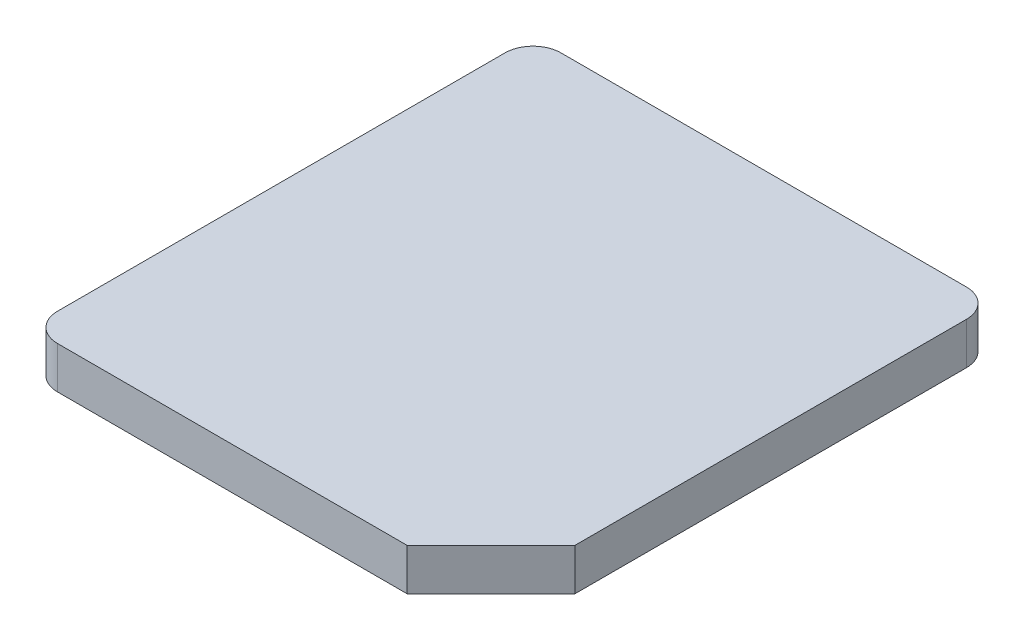
ISO-10303-21;
HEADER;
FILE_DESCRIPTION(('STEP AP214'),'2;1');
FILE_NAME('part.step','',(''),(''),'','','');
FILE_SCHEMA(('AUTOMOTIVE_DESIGN { 1 0 10303 214 1 1 1 1 }'));
ENDSEC;
DATA;
#1=APPLICATION_CONTEXT('core data for automotive mechanical design processes');
#2=APPLICATION_PROTOCOL_DEFINITION('international standard','automotive_design',2000,#1);
#3=PRODUCT_CONTEXT('',#1,'mechanical');
#4=PRODUCT('Part','Part','',(#3));
#5=PRODUCT_RELATED_PRODUCT_CATEGORY('part','',(#4));
#6=PRODUCT_DEFINITION_FORMATION('','',#4);
#7=PRODUCT_DEFINITION_CONTEXT('part definition',#1,'design');
#8=PRODUCT_DEFINITION('design','',#6,#7);
#9=PRODUCT_DEFINITION_SHAPE('','',#8);
#10=(LENGTH_UNIT() NAMED_UNIT(*) SI_UNIT(.MILLI.,.METRE.));
#11=(NAMED_UNIT(*) PLANE_ANGLE_UNIT() SI_UNIT($,.RADIAN.));
#12=(NAMED_UNIT(*) SI_UNIT($,.STERADIAN.) SOLID_ANGLE_UNIT());
#13=UNCERTAINTY_MEASURE_WITH_UNIT(LENGTH_MEASURE(1.E-05),#10,'distance_accuracy_value','');
#14=(GEOMETRIC_REPRESENTATION_CONTEXT(3) GLOBAL_UNCERTAINTY_ASSIGNED_CONTEXT((#13)) GLOBAL_UNIT_ASSIGNED_CONTEXT((#10,
#11,#12)) REPRESENTATION_CONTEXT('',''));
#15=CARTESIAN_POINT('',(0.,0.,0.));
#16=DIRECTION('',(0.,0.,1.));
#17=DIRECTION('',(1.,0.,0.));
#18=AXIS2_PLACEMENT_3D('',#15,#16,#17);
#19=CARTESIAN_POINT('',(0.825,0.15,-0.9));
#20=DIRECTION('',(-1.,0.,0.));
#21=DIRECTION('',(0.,0.,1.));
#22=AXIS2_PLACEMENT_3D('',#19,#20,#21);
#23=PLANE('',#22);
#24=DIRECTION('',(0.,0.,-1.));
#25=VECTOR('',#24,1.);
#26=CARTESIAN_POINT('',(0.825,0.,-0.9));
#27=LINE('',#26,#25);
#28=CARTESIAN_POINT('',(0.825,0.,0.6));
#29=VERTEX_POINT('',#28);
#30=CARTESIAN_POINT('',(0.825,0.,-0.8));
#31=VERTEX_POINT('',#30);
#32=EDGE_CURVE('E124',#29,#31,#27,.T.);
#33=ORIENTED_EDGE('',*,*,#32,.T.);
#34=DIRECTION('',(0.,-1.,0.));
#35=VECTOR('',#34,1.);
#36=CARTESIAN_POINT('',(0.825,0.15,-0.8));
#37=LINE('',#36,#35);
#38=CARTESIAN_POINT('',(0.825,0.15,-0.8));
#39=VERTEX_POINT('',#38);
#40=EDGE_CURVE('E166',#31,#39,#37,.F.);
#41=ORIENTED_EDGE('',*,*,#40,.T.);
#42=DIRECTION('',(0.,0.,-1.));
#43=VECTOR('',#42,1.);
#44=CARTESIAN_POINT('',(0.825,0.15,-0.9));
#45=LINE('',#44,#43);
#46=CARTESIAN_POINT('',(0.825,0.15,0.6));
#47=VERTEX_POINT('',#46);
#48=EDGE_CURVE('E127',#47,#39,#45,.T.);
#49=ORIENTED_EDGE('',*,*,#48,.F.);
#50=DIRECTION('',(0.,1.,0.));
#51=VECTOR('',#50,1.);
#52=CARTESIAN_POINT('',(0.825,0.,0.6));
#53=LINE('',#52,#51);
#54=EDGE_CURVE('E111',#29,#47,#53,.T.);
#55=ORIENTED_EDGE('',*,*,#54,.F.);
#56=EDGE_LOOP('',(#33,#41,#49,#55));
#57=FACE_BOUND('',#56,.T.);
#58=ADVANCED_FACE('F39',(#57),#23,.F.);
#59=CARTESIAN_POINT('',(-0.825,0.15,-0.9));
#60=DIRECTION('',(0.,0.,1.));
#61=DIRECTION('',(1.,0.,0.));
#62=AXIS2_PLACEMENT_3D('',#59,#60,#61);
#63=PLANE('',#62);
#64=DIRECTION('',(-1.,0.,0.));
#65=VECTOR('',#64,1.);
#66=CARTESIAN_POINT('',(-0.825,0.15,-0.9));
#67=LINE('',#66,#65);
#68=CARTESIAN_POINT('',(0.725,0.15,-0.9));
#69=VERTEX_POINT('',#68);
#70=CARTESIAN_POINT('',(-0.725,0.15,-0.9));
#71=VERTEX_POINT('',#70);
#72=EDGE_CURVE('E192',#69,#71,#67,.T.);
#73=ORIENTED_EDGE('',*,*,#72,.F.);
#74=DIRECTION('',(0.,-1.,0.));
#75=VECTOR('',#74,1.);
#76=CARTESIAN_POINT('',(0.725,0.15,-0.9));
#77=LINE('',#76,#75);
#78=CARTESIAN_POINT('',(0.725,0.,-0.9));
#79=VERTEX_POINT('',#78);
#80=EDGE_CURVE('E154',#69,#79,#77,.T.);
#81=ORIENTED_EDGE('',*,*,#80,.T.);
#82=DIRECTION('',(-1.,0.,0.));
#83=VECTOR('',#82,1.);
#84=CARTESIAN_POINT('',(-0.825,0.,-0.9));
#85=LINE('',#84,#83);
#86=CARTESIAN_POINT('',(-0.725,0.,-0.9));
#87=VERTEX_POINT('',#86);
#88=EDGE_CURVE('E134',#79,#87,#85,.T.);
#89=ORIENTED_EDGE('',*,*,#88,.T.);
#90=DIRECTION('',(0.,-1.,0.));
#91=VECTOR('',#90,1.);
#92=CARTESIAN_POINT('',(-0.725,0.15,-0.9));
#93=LINE('',#92,#91);
#94=EDGE_CURVE('E151',#87,#71,#93,.F.);
#95=ORIENTED_EDGE('',*,*,#94,.T.);
#96=EDGE_LOOP('',(#73,#81,#89,#95));
#97=FACE_BOUND('',#96,.T.);
#98=ADVANCED_FACE('F207',(#97),#63,.F.);
#99=CARTESIAN_POINT('',(-0.825,0.15,-0.9));
#100=DIRECTION('',(1.,0.,0.));
#101=DIRECTION('',(0.,0.,-1.));
#102=AXIS2_PLACEMENT_3D('',#99,#100,#101);
#103=PLANE('',#102);
#104=DIRECTION('',(0.,0.,1.));
#105=VECTOR('',#104,1.);
#106=CARTESIAN_POINT('',(-0.825,0.15,-0.9));
#107=LINE('',#106,#105);
#108=CARTESIAN_POINT('',(-0.825,0.15,-0.8));
#109=VERTEX_POINT('',#108);
#110=CARTESIAN_POINT('',(-0.825,0.15,0.8));
#111=VERTEX_POINT('',#110);
#112=EDGE_CURVE('E183',#109,#111,#107,.T.);
#113=ORIENTED_EDGE('',*,*,#112,.F.);
#114=DIRECTION('',(0.,-1.,0.));
#115=VECTOR('',#114,1.);
#116=CARTESIAN_POINT('',(-0.825,0.15,-0.8));
#117=LINE('',#116,#115);
#118=CARTESIAN_POINT('',(-0.825,0.,-0.8));
#119=VERTEX_POINT('',#118);
#120=EDGE_CURVE('E48',#109,#119,#117,.T.);
#121=ORIENTED_EDGE('',*,*,#120,.T.);
#122=DIRECTION('',(0.,0.,1.));
#123=VECTOR('',#122,1.);
#124=CARTESIAN_POINT('',(-0.825,0.,-0.9));
#125=LINE('',#124,#123);
#126=CARTESIAN_POINT('',(-0.825,0.,0.8));
#127=VERTEX_POINT('',#126);
#128=EDGE_CURVE('E139',#119,#127,#125,.T.);
#129=ORIENTED_EDGE('',*,*,#128,.T.);
#130=DIRECTION('',(0.,-1.,0.));
#131=VECTOR('',#130,1.);
#132=CARTESIAN_POINT('',(-0.825,0.15,0.8));
#133=LINE('',#132,#131);
#134=EDGE_CURVE('E63',#127,#111,#133,.F.);
#135=ORIENTED_EDGE('',*,*,#134,.T.);
#136=EDGE_LOOP('',(#113,#121,#129,#135));
#137=FACE_BOUND('',#136,.T.);
#138=ADVANCED_FACE('F182',(#137),#103,.F.);
#139=CARTESIAN_POINT('',(-0.825,0.15,0.9));
#140=DIRECTION('',(0.,0.,-1.));
#141=DIRECTION('',(-1.,0.,0.));
#142=AXIS2_PLACEMENT_3D('',#139,#140,#141);
#143=PLANE('',#142);
#144=DIRECTION('',(1.,0.,0.));
#145=VECTOR('',#144,1.);
#146=CARTESIAN_POINT('',(-0.825,0.15,0.9));
#147=LINE('',#146,#145);
#148=CARTESIAN_POINT('',(-0.725,0.15,0.9));
#149=VERTEX_POINT('',#148);
#150=CARTESIAN_POINT('',(0.525,0.15,0.9));
#151=VERTEX_POINT('',#150);
#152=EDGE_CURVE('E143',#149,#151,#147,.T.);
#153=ORIENTED_EDGE('',*,*,#152,.F.);
#154=DIRECTION('',(0.,-1.,0.));
#155=VECTOR('',#154,1.);
#156=CARTESIAN_POINT('',(-0.725,0.15,0.9));
#157=LINE('',#156,#155);
#158=CARTESIAN_POINT('',(-0.725,0.,0.9));
#159=VERTEX_POINT('',#158);
#160=EDGE_CURVE('E11',#149,#159,#157,.T.);
#161=ORIENTED_EDGE('',*,*,#160,.T.);
#162=DIRECTION('',(1.,0.,0.));
#163=VECTOR('',#162,1.);
#164=CARTESIAN_POINT('',(-0.825,0.,0.9));
#165=LINE('',#164,#163);
#166=CARTESIAN_POINT('',(0.525,0.,0.9));
#167=VERTEX_POINT('',#166);
#168=EDGE_CURVE('E148',#159,#167,#165,.T.);
#169=ORIENTED_EDGE('',*,*,#168,.T.);
#170=DIRECTION('',(0.,1.,0.));
#171=VECTOR('',#170,1.);
#172=CARTESIAN_POINT('',(0.525,0.,0.9));
#173=LINE('',#172,#171);
#174=EDGE_CURVE('E114',#167,#151,#173,.T.);
#175=ORIENTED_EDGE('',*,*,#174,.T.);
#176=EDGE_LOOP('',(#153,#161,#169,#175));
#177=FACE_BOUND('',#176,.T.);
#178=ADVANCED_FACE('F189',(#177),#143,.F.);
#179=CARTESIAN_POINT('',(0.,0.15,0.));
#180=DIRECTION('',(0.,1.,0.));
#181=DIRECTION('',(0.,0.,1.));
#182=AXIS2_PLACEMENT_3D('',#179,#180,#181);
#183=PLANE('',#182);
#184=ORIENTED_EDGE('',*,*,#48,.T.);
#185=CARTESIAN_POINT('',(0.725,0.15,-0.8));
#186=DIRECTION('',(0.,1.,0.));
#187=DIRECTION('',(0.,0.,1.));
#188=AXIS2_PLACEMENT_3D('',#185,#186,#187);
#189=CIRCLE('',#188,0.1);
#190=EDGE_CURVE('E174',#39,#69,#189,.T.);
#191=ORIENTED_EDGE('',*,*,#190,.T.);
#192=ORIENTED_EDGE('',*,*,#72,.T.);
#193=CARTESIAN_POINT('',(-0.725,0.15,-0.8));
#194=DIRECTION('',(0.,1.,0.));
#195=DIRECTION('',(0.,0.,1.));
#196=AXIS2_PLACEMENT_3D('',#193,#194,#195);
#197=CIRCLE('',#196,0.1);
#198=EDGE_CURVE('E171',#71,#109,#197,.T.);
#199=ORIENTED_EDGE('',*,*,#198,.T.);
#200=ORIENTED_EDGE('',*,*,#112,.T.);
#201=CARTESIAN_POINT('',(-0.725,0.15,0.8));
#202=DIRECTION('',(0.,1.,0.));
#203=DIRECTION('',(0.,0.,1.));
#204=AXIS2_PLACEMENT_3D('',#201,#202,#203);
#205=CIRCLE('',#204,0.1);
#206=EDGE_CURVE('E55',#111,#149,#205,.T.);
#207=ORIENTED_EDGE('',*,*,#206,.T.);
#208=ORIENTED_EDGE('',*,*,#152,.T.);
#209=DIRECTION('',(-0.707106781186547,0.,0.707106781186547));
#210=VECTOR('',#209,1.);
#211=CARTESIAN_POINT('',(0.525,0.15,0.9));
#212=LINE('',#211,#210);
#213=EDGE_CURVE('E119',#47,#151,#212,.T.);
#214=ORIENTED_EDGE('',*,*,#213,.F.);
#215=EDGE_LOOP('',(#184,#191,#192,#199,#200,#207,#208,#214));
#216=FACE_BOUND('',#215,.T.);
#217=ADVANCED_FACE('F200',(#216),#183,.T.);
#218=CARTESIAN_POINT('',(0.,0.,0.));
#219=DIRECTION('',(0.,1.,0.));
#220=DIRECTION('',(0.,0.,1.));
#221=AXIS2_PLACEMENT_3D('',#218,#219,#220);
#222=PLANE('',#221);
#223=ORIENTED_EDGE('',*,*,#88,.F.);
#224=CARTESIAN_POINT('',(0.725,0.,-0.8));
#225=DIRECTION('',(0.,1.,0.));
#226=DIRECTION('',(0.,0.,1.));
#227=AXIS2_PLACEMENT_3D('',#224,#225,#226);
#228=CIRCLE('',#227,0.1);
#229=EDGE_CURVE('E132',#79,#31,#228,.F.);
#230=ORIENTED_EDGE('',*,*,#229,.T.);
#231=ORIENTED_EDGE('',*,*,#32,.F.);
#232=DIRECTION('',(-0.707106781186547,0.,0.707106781186547));
#233=VECTOR('',#232,1.);
#234=CARTESIAN_POINT('',(0.525,0.,0.9));
#235=LINE('',#234,#233);
#236=EDGE_CURVE('E107',#29,#167,#235,.T.);
#237=ORIENTED_EDGE('',*,*,#236,.T.);
#238=ORIENTED_EDGE('',*,*,#168,.F.);
#239=CARTESIAN_POINT('',(-0.725,0.,0.8));
#240=DIRECTION('',(0.,1.,0.));
#241=DIRECTION('',(0.,0.,1.));
#242=AXIS2_PLACEMENT_3D('',#239,#240,#241);
#243=CIRCLE('',#242,0.1);
#244=EDGE_CURVE('E158',#159,#127,#243,.F.);
#245=ORIENTED_EDGE('',*,*,#244,.T.);
#246=ORIENTED_EDGE('',*,*,#128,.F.);
#247=CARTESIAN_POINT('',(-0.725,0.,-0.8));
#248=DIRECTION('',(0.,1.,0.));
#249=DIRECTION('',(0.,0.,1.));
#250=AXIS2_PLACEMENT_3D('',#247,#248,#249);
#251=CIRCLE('',#250,0.1);
#252=EDGE_CURVE('E161',#119,#87,#251,.F.);
#253=ORIENTED_EDGE('',*,*,#252,.T.);
#254=EDGE_LOOP('',(#223,#230,#231,#237,#238,#245,#246,#253));
#255=FACE_BOUND('',#254,.T.);
#256=ADVANCED_FACE('F131',(#255),#222,.F.);
#257=CARTESIAN_POINT('',(0.525,0.,0.9));
#258=DIRECTION('',(-0.707106781186547,0.,-0.707106781186547));
#259=DIRECTION('',(-0.707106781186548,0.,0.707106781186548));
#260=AXIS2_PLACEMENT_3D('',#257,#258,#259);
#261=PLANE('',#260);
#262=ORIENTED_EDGE('',*,*,#213,.T.);
#263=ORIENTED_EDGE('',*,*,#174,.F.);
#264=ORIENTED_EDGE('',*,*,#236,.F.);
#265=ORIENTED_EDGE('',*,*,#54,.T.);
#266=EDGE_LOOP('',(#262,#263,#264,#265));
#267=FACE_BOUND('',#266,.T.);
#268=ADVANCED_FACE('F110',(#267),#261,.F.);
#269=CARTESIAN_POINT('',(0.725,0.15,-0.8));
#270=DIRECTION('',(0.,-1.,0.));
#271=DIRECTION('',(0.,0.,-1.));
#272=AXIS2_PLACEMENT_3D('',#269,#270,#271);
#273=CYLINDRICAL_SURFACE('',#272,0.1);
#274=ORIENTED_EDGE('',*,*,#190,.F.);
#275=ORIENTED_EDGE('',*,*,#40,.F.);
#276=ORIENTED_EDGE('',*,*,#229,.F.);
#277=ORIENTED_EDGE('',*,*,#80,.F.);
#278=EDGE_LOOP('',(#274,#275,#276,#277));
#279=FACE_BOUND('',#278,.T.);
#280=ADVANCED_FACE('F205',(#279),#273,.T.);
#281=CARTESIAN_POINT('',(-0.725,0.15,-0.8));
#282=DIRECTION('',(0.,-1.,0.));
#283=DIRECTION('',(0.,0.,-1.));
#284=AXIS2_PLACEMENT_3D('',#281,#282,#283);
#285=CYLINDRICAL_SURFACE('',#284,0.1);
#286=ORIENTED_EDGE('',*,*,#198,.F.);
#287=ORIENTED_EDGE('',*,*,#94,.F.);
#288=ORIENTED_EDGE('',*,*,#252,.F.);
#289=ORIENTED_EDGE('',*,*,#120,.F.);
#290=EDGE_LOOP('',(#286,#287,#288,#289));
#291=FACE_BOUND('',#290,.T.);
#292=ADVANCED_FACE('F209',(#291),#285,.T.);
#293=CARTESIAN_POINT('',(-0.725,0.15,0.8));
#294=DIRECTION('',(0.,-1.,0.));
#295=DIRECTION('',(0.,0.,-1.));
#296=AXIS2_PLACEMENT_3D('',#293,#294,#295);
#297=CYLINDRICAL_SURFACE('',#296,0.1);
#298=ORIENTED_EDGE('',*,*,#206,.F.);
#299=ORIENTED_EDGE('',*,*,#134,.F.);
#300=ORIENTED_EDGE('',*,*,#244,.F.);
#301=ORIENTED_EDGE('',*,*,#160,.F.);
#302=EDGE_LOOP('',(#298,#299,#300,#301));
#303=FACE_BOUND('',#302,.T.);
#304=ADVANCED_FACE('F41',(#303),#297,.T.);
#305=CLOSED_SHELL('',(#58,#98,#138,#178,#217,#256,#268,#280,#292,#304));
#306=MANIFOLD_SOLID_BREP('B2',#305);
#307=ADVANCED_BREP_SHAPE_REPRESENTATION('',(#18,#306),#14);
#308=SHAPE_DEFINITION_REPRESENTATION(#9,#307);
ENDSEC;
END-ISO-10303-21;
